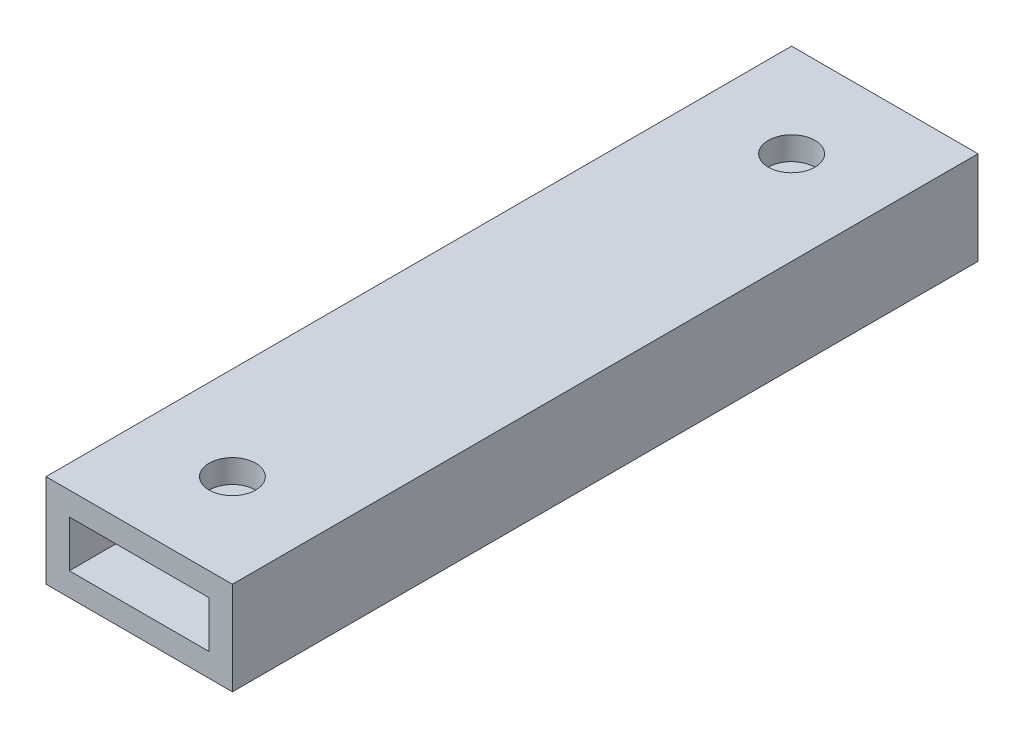
ISO-10303-21;
HEADER;
FILE_DESCRIPTION(('STEP AP214'),'2;1');
FILE_NAME('part.step','',(''),(''),'','','');
FILE_SCHEMA(('AUTOMOTIVE_DESIGN { 1 0 10303 214 1 1 1 1 }'));
ENDSEC;
DATA;
#1=APPLICATION_CONTEXT('core data for automotive mechanical design processes');
#2=APPLICATION_PROTOCOL_DEFINITION('international standard','automotive_design',2000,#1);
#3=PRODUCT_CONTEXT('',#1,'mechanical');
#4=PRODUCT('Part','Part','',(#3));
#5=PRODUCT_RELATED_PRODUCT_CATEGORY('part','',(#4));
#6=PRODUCT_DEFINITION_FORMATION('','',#4);
#7=PRODUCT_DEFINITION_CONTEXT('part definition',#1,'design');
#8=PRODUCT_DEFINITION('design','',#6,#7);
#9=PRODUCT_DEFINITION_SHAPE('','',#8);
#10=(LENGTH_UNIT() NAMED_UNIT(*) SI_UNIT(.MILLI.,.METRE.));
#11=(NAMED_UNIT(*) PLANE_ANGLE_UNIT() SI_UNIT($,.RADIAN.));
#12=(NAMED_UNIT(*) SI_UNIT($,.STERADIAN.) SOLID_ANGLE_UNIT());
#13=UNCERTAINTY_MEASURE_WITH_UNIT(LENGTH_MEASURE(1.E-05),#10,'distance_accuracy_value','');
#14=(GEOMETRIC_REPRESENTATION_CONTEXT(3) GLOBAL_UNCERTAINTY_ASSIGNED_CONTEXT((#13)) GLOBAL_UNIT_ASSIGNED_CONTEXT((#10,
#11,#12)) REPRESENTATION_CONTEXT('',''));
#15=CARTESIAN_POINT('',(0.,0.,0.));
#16=DIRECTION('',(0.,0.,1.));
#17=DIRECTION('',(1.,0.,0.));
#18=AXIS2_PLACEMENT_3D('',#15,#16,#17);
#19=CARTESIAN_POINT('',(0.,0.,101.6));
#20=DIRECTION('',(0.,0.,-1.));
#21=DIRECTION('',(-1.,0.,0.));
#22=AXIS2_PLACEMENT_3D('',#19,#20,#21);
#23=PLANE('',#22);
#24=DIRECTION('',(0.,-1.,0.));
#25=VECTOR('',#24,1.);
#26=CARTESIAN_POINT('',(0.,0.,101.6));
#27=LINE('',#26,#25);
#28=CARTESIAN_POINT('',(0.,12.7,101.6));
#29=VERTEX_POINT('',#28);
#30=CARTESIAN_POINT('',(0.,0.,101.6));
#31=VERTEX_POINT('',#30);
#32=EDGE_CURVE('E175',#29,#31,#27,.T.);
#33=ORIENTED_EDGE('',*,*,#32,.T.);
#34=DIRECTION('',(1.,0.,0.));
#35=VECTOR('',#34,1.);
#36=CARTESIAN_POINT('',(0.,0.,101.6));
#37=LINE('',#36,#35);
#38=CARTESIAN_POINT('',(25.4,0.,101.6));
#39=VERTEX_POINT('',#38);
#40=EDGE_CURVE('E179',#31,#39,#37,.T.);
#41=ORIENTED_EDGE('',*,*,#40,.T.);
#42=DIRECTION('',(0.,1.,0.));
#43=VECTOR('',#42,1.);
#44=CARTESIAN_POINT('',(25.4,0.,101.6));
#45=LINE('',#44,#43);
#46=CARTESIAN_POINT('',(25.4,12.7,101.6));
#47=VERTEX_POINT('',#46);
#48=EDGE_CURVE('E183',#39,#47,#45,.T.);
#49=ORIENTED_EDGE('',*,*,#48,.T.);
#50=DIRECTION('',(-1.,0.,0.));
#51=VECTOR('',#50,1.);
#52=CARTESIAN_POINT('',(0.,12.7,101.6));
#53=LINE('',#52,#51);
#54=EDGE_CURVE('E186',#47,#29,#53,.T.);
#55=ORIENTED_EDGE('',*,*,#54,.T.);
#56=EDGE_LOOP('',(#33,#41,#49,#55));
#57=FACE_BOUND('',#56,.T.);
#58=DIRECTION('',(0.,-1.,0.));
#59=VECTOR('',#58,1.);
#60=CARTESIAN_POINT('',(3.175,3.175,101.6));
#61=LINE('',#60,#59);
#62=CARTESIAN_POINT('',(3.175,9.525,101.6));
#63=VERTEX_POINT('',#62);
#64=CARTESIAN_POINT('',(3.175,3.175,101.6));
#65=VERTEX_POINT('',#64);
#66=EDGE_CURVE('E124',#63,#65,#61,.T.);
#67=ORIENTED_EDGE('',*,*,#66,.F.);
#68=DIRECTION('',(-1.,0.,0.));
#69=VECTOR('',#68,1.);
#70=CARTESIAN_POINT('',(3.175,9.525,101.6));
#71=LINE('',#70,#69);
#72=CARTESIAN_POINT('',(22.225,9.525,101.6));
#73=VERTEX_POINT('',#72);
#74=EDGE_CURVE('E151',#73,#63,#71,.T.);
#75=ORIENTED_EDGE('',*,*,#74,.F.);
#76=DIRECTION('',(0.,1.,0.));
#77=VECTOR('',#76,1.);
#78=CARTESIAN_POINT('',(22.225,3.175,101.6));
#79=LINE('',#78,#77);
#80=CARTESIAN_POINT('',(22.225,3.175,101.6));
#81=VERTEX_POINT('',#80);
#82=EDGE_CURVE('E146',#81,#73,#79,.T.);
#83=ORIENTED_EDGE('',*,*,#82,.F.);
#84=DIRECTION('',(1.,0.,0.));
#85=VECTOR('',#84,1.);
#86=CARTESIAN_POINT('',(3.175,3.175,101.6));
#87=LINE('',#86,#85);
#88=EDGE_CURVE('E133',#65,#81,#87,.T.);
#89=ORIENTED_EDGE('',*,*,#88,.F.);
#90=EDGE_LOOP('',(#67,#75,#83,#89));
#91=FACE_BOUND('',#90,.T.);
#92=ADVANCED_FACE('F40',(#57,#91),#23,.F.);
#93=CARTESIAN_POINT('',(0.,0.,0.));
#94=DIRECTION('',(0.,0.,-1.));
#95=DIRECTION('',(-1.,0.,0.));
#96=AXIS2_PLACEMENT_3D('',#93,#94,#95);
#97=PLANE('',#96);
#98=DIRECTION('',(0.,-1.,0.));
#99=VECTOR('',#98,1.);
#100=CARTESIAN_POINT('',(0.,0.,0.));
#101=LINE('',#100,#99);
#102=CARTESIAN_POINT('',(0.,12.7,0.));
#103=VERTEX_POINT('',#102);
#104=CARTESIAN_POINT('',(0.,0.,0.));
#105=VERTEX_POINT('',#104);
#106=EDGE_CURVE('E142',#103,#105,#101,.T.);
#107=ORIENTED_EDGE('',*,*,#106,.F.);
#108=DIRECTION('',(-1.,0.,0.));
#109=VECTOR('',#108,1.);
#110=CARTESIAN_POINT('',(0.,12.7,0.));
#111=LINE('',#110,#109);
#112=CARTESIAN_POINT('',(25.4,12.7,0.));
#113=VERTEX_POINT('',#112);
#114=EDGE_CURVE('E180',#113,#103,#111,.T.);
#115=ORIENTED_EDGE('',*,*,#114,.F.);
#116=DIRECTION('',(0.,1.,0.));
#117=VECTOR('',#116,1.);
#118=CARTESIAN_POINT('',(25.4,0.,0.));
#119=LINE('',#118,#117);
#120=CARTESIAN_POINT('',(25.4,0.,0.));
#121=VERTEX_POINT('',#120);
#122=EDGE_CURVE('E196',#121,#113,#119,.T.);
#123=ORIENTED_EDGE('',*,*,#122,.F.);
#124=DIRECTION('',(1.,0.,0.));
#125=VECTOR('',#124,1.);
#126=CARTESIAN_POINT('',(0.,0.,0.));
#127=LINE('',#126,#125);
#128=EDGE_CURVE('E193',#105,#121,#127,.T.);
#129=ORIENTED_EDGE('',*,*,#128,.F.);
#130=EDGE_LOOP('',(#107,#115,#123,#129));
#131=FACE_BOUND('',#130,.T.);
#132=DIRECTION('',(-1.,0.,0.));
#133=VECTOR('',#132,1.);
#134=CARTESIAN_POINT('',(3.175,9.525,0.));
#135=LINE('',#134,#133);
#136=CARTESIAN_POINT('',(22.225,9.525,0.));
#137=VERTEX_POINT('',#136);
#138=CARTESIAN_POINT('',(3.175,9.525,0.));
#139=VERTEX_POINT('',#138);
#140=EDGE_CURVE('E134',#137,#139,#135,.T.);
#141=ORIENTED_EDGE('',*,*,#140,.T.);
#142=DIRECTION('',(0.,-1.,0.));
#143=VECTOR('',#142,1.);
#144=CARTESIAN_POINT('',(3.175,3.175,0.));
#145=LINE('',#144,#143);
#146=CARTESIAN_POINT('',(3.175,3.175,0.));
#147=VERTEX_POINT('',#146);
#148=EDGE_CURVE('E72',#139,#147,#145,.T.);
#149=ORIENTED_EDGE('',*,*,#148,.T.);
#150=DIRECTION('',(1.,0.,0.));
#151=VECTOR('',#150,1.);
#152=CARTESIAN_POINT('',(3.175,3.175,0.));
#153=LINE('',#152,#151);
#154=CARTESIAN_POINT('',(22.225,3.175,0.));
#155=VERTEX_POINT('',#154);
#156=EDGE_CURVE('E140',#147,#155,#153,.T.);
#157=ORIENTED_EDGE('',*,*,#156,.T.);
#158=DIRECTION('',(0.,1.,0.));
#159=VECTOR('',#158,1.);
#160=CARTESIAN_POINT('',(22.225,3.175,0.));
#161=LINE('',#160,#159);
#162=EDGE_CURVE('E162',#155,#137,#161,.T.);
#163=ORIENTED_EDGE('',*,*,#162,.T.);
#164=EDGE_LOOP('',(#141,#149,#157,#163));
#165=FACE_BOUND('',#164,.T.);
#166=ADVANCED_FACE('F255',(#131,#165),#97,.T.);
#167=CARTESIAN_POINT('',(0.,0.,101.6));
#168=DIRECTION('',(1.,0.,0.));
#169=DIRECTION('',(0.,0.,-1.));
#170=AXIS2_PLACEMENT_3D('',#167,#168,#169);
#171=PLANE('',#170);
#172=ORIENTED_EDGE('',*,*,#106,.T.);
#173=DIRECTION('',(0.,0.,-1.));
#174=VECTOR('',#173,1.);
#175=CARTESIAN_POINT('',(0.,0.,101.6));
#176=LINE('',#175,#174);
#177=EDGE_CURVE('E11',#31,#105,#176,.T.);
#178=ORIENTED_EDGE('',*,*,#177,.F.);
#179=ORIENTED_EDGE('',*,*,#32,.F.);
#180=DIRECTION('',(0.,0.,-1.));
#181=VECTOR('',#180,1.);
#182=CARTESIAN_POINT('',(0.,12.7,101.6));
#183=LINE('',#182,#181);
#184=EDGE_CURVE('E189',#29,#103,#183,.T.);
#185=ORIENTED_EDGE('',*,*,#184,.T.);
#186=EDGE_LOOP('',(#172,#178,#179,#185));
#187=FACE_BOUND('',#186,.T.);
#188=ADVANCED_FACE('F42',(#187),#171,.F.);
#189=CARTESIAN_POINT('',(0.,0.,101.6));
#190=DIRECTION('',(0.,1.,0.));
#191=DIRECTION('',(0.,0.,1.));
#192=AXIS2_PLACEMENT_3D('',#189,#190,#191);
#193=PLANE('',#192);
#194=CARTESIAN_POINT('',(12.7,0.,88.9));
#195=DIRECTION('',(0.,1.,0.));
#196=DIRECTION('',(0.,0.,1.));
#197=AXIS2_PLACEMENT_3D('',#194,#195,#196);
#198=CIRCLE('',#197,3.175);
#199=CARTESIAN_POINT('',(12.7,0.,92.075));
#200=VERTEX_POINT('',#199);
#201=EDGE_CURVE('E214',#200,#200,#198,.T.);
#202=ORIENTED_EDGE('',*,*,#201,.T.);
#203=EDGE_LOOP('',(#202));
#204=FACE_BOUND('',#203,.T.);
#205=CARTESIAN_POINT('',(12.7,0.,12.7));
#206=DIRECTION('',(0.,1.,0.));
#207=DIRECTION('',(0.,0.,1.));
#208=AXIS2_PLACEMENT_3D('',#205,#206,#207);
#209=CIRCLE('',#208,3.175);
#210=CARTESIAN_POINT('',(12.7,0.,15.875));
#211=VERTEX_POINT('',#210);
#212=EDGE_CURVE('E229',#211,#211,#209,.T.);
#213=ORIENTED_EDGE('',*,*,#212,.T.);
#214=EDGE_LOOP('',(#213));
#215=FACE_BOUND('',#214,.T.);
#216=ORIENTED_EDGE('',*,*,#128,.T.);
#217=DIRECTION('',(0.,0.,-1.));
#218=VECTOR('',#217,1.);
#219=CARTESIAN_POINT('',(25.4,0.,101.6));
#220=LINE('',#219,#218);
#221=EDGE_CURVE('E50',#39,#121,#220,.T.);
#222=ORIENTED_EDGE('',*,*,#221,.F.);
#223=ORIENTED_EDGE('',*,*,#40,.F.);
#224=ORIENTED_EDGE('',*,*,#177,.T.);
#225=EDGE_LOOP('',(#216,#222,#223,#224));
#226=FACE_BOUND('',#225,.T.);
#227=ADVANCED_FACE('F280',(#204,#215,#226),#193,.F.);
#228=CARTESIAN_POINT('',(25.4,0.,101.6));
#229=DIRECTION('',(-1.,0.,0.));
#230=DIRECTION('',(0.,0.,1.));
#231=AXIS2_PLACEMENT_3D('',#228,#229,#230);
#232=PLANE('',#231);
#233=ORIENTED_EDGE('',*,*,#122,.T.);
#234=DIRECTION('',(0.,0.,-1.));
#235=VECTOR('',#234,1.);
#236=CARTESIAN_POINT('',(25.4,12.7,101.6));
#237=LINE('',#236,#235);
#238=EDGE_CURVE('E204',#47,#113,#237,.T.);
#239=ORIENTED_EDGE('',*,*,#238,.F.);
#240=ORIENTED_EDGE('',*,*,#48,.F.);
#241=ORIENTED_EDGE('',*,*,#221,.T.);
#242=EDGE_LOOP('',(#233,#239,#240,#241));
#243=FACE_BOUND('',#242,.T.);
#244=ADVANCED_FACE('F277',(#243),#232,.F.);
#245=CARTESIAN_POINT('',(0.,12.7,101.6));
#246=DIRECTION('',(0.,-1.,0.));
#247=DIRECTION('',(0.,0.,-1.));
#248=AXIS2_PLACEMENT_3D('',#245,#246,#247);
#249=PLANE('',#248);
#250=CARTESIAN_POINT('',(12.7,12.7,88.9));
#251=DIRECTION('',(0.,1.,0.));
#252=DIRECTION('',(0.,0.,1.));
#253=AXIS2_PLACEMENT_3D('',#250,#251,#252);
#254=CIRCLE('',#253,3.175);
#255=CARTESIAN_POINT('',(12.7,12.7,92.075));
#256=VERTEX_POINT('',#255);
#257=EDGE_CURVE('E222',#256,#256,#254,.T.);
#258=ORIENTED_EDGE('',*,*,#257,.F.);
#259=EDGE_LOOP('',(#258));
#260=FACE_BOUND('',#259,.T.);
#261=CARTESIAN_POINT('',(12.7,12.7,12.7));
#262=DIRECTION('',(0.,1.,0.));
#263=DIRECTION('',(0.,0.,1.));
#264=AXIS2_PLACEMENT_3D('',#261,#262,#263);
#265=CIRCLE('',#264,3.175);
#266=CARTESIAN_POINT('',(12.7,12.7,15.875));
#267=VERTEX_POINT('',#266);
#268=EDGE_CURVE('E235',#267,#267,#265,.T.);
#269=ORIENTED_EDGE('',*,*,#268,.F.);
#270=EDGE_LOOP('',(#269));
#271=FACE_BOUND('',#270,.T.);
#272=ORIENTED_EDGE('',*,*,#114,.T.);
#273=ORIENTED_EDGE('',*,*,#184,.F.);
#274=ORIENTED_EDGE('',*,*,#54,.F.);
#275=ORIENTED_EDGE('',*,*,#238,.T.);
#276=EDGE_LOOP('',(#272,#273,#274,#275));
#277=FACE_BOUND('',#276,.T.);
#278=ADVANCED_FACE('F274',(#260,#271,#277),#249,.F.);
#279=CARTESIAN_POINT('',(3.175,3.175,101.6));
#280=DIRECTION('',(1.,0.,0.));
#281=DIRECTION('',(0.,0.,-1.));
#282=AXIS2_PLACEMENT_3D('',#279,#280,#281);
#283=PLANE('',#282);
#284=ORIENTED_EDGE('',*,*,#148,.F.);
#285=DIRECTION('',(0.,0.,-1.));
#286=VECTOR('',#285,1.);
#287=CARTESIAN_POINT('',(3.175,9.525,101.6));
#288=LINE('',#287,#286);
#289=EDGE_CURVE('E128',#63,#139,#288,.T.);
#290=ORIENTED_EDGE('',*,*,#289,.F.);
#291=ORIENTED_EDGE('',*,*,#66,.T.);
#292=DIRECTION('',(0.,0.,-1.));
#293=VECTOR('',#292,1.);
#294=CARTESIAN_POINT('',(3.175,3.175,101.6));
#295=LINE('',#294,#293);
#296=EDGE_CURVE('E127',#65,#147,#295,.T.);
#297=ORIENTED_EDGE('',*,*,#296,.T.);
#298=EDGE_LOOP('',(#284,#290,#291,#297));
#299=FACE_BOUND('',#298,.T.);
#300=ADVANCED_FACE('F126',(#299),#283,.T.);
#301=CARTESIAN_POINT('',(3.175,3.175,101.6));
#302=DIRECTION('',(0.,1.,0.));
#303=DIRECTION('',(0.,0.,1.));
#304=AXIS2_PLACEMENT_3D('',#301,#302,#303);
#305=PLANE('',#304);
#306=CARTESIAN_POINT('',(12.7,3.175,88.9));
#307=DIRECTION('',(0.,1.,0.));
#308=DIRECTION('',(0.,0.,1.));
#309=AXIS2_PLACEMENT_3D('',#306,#307,#308);
#310=CIRCLE('',#309,3.175);
#311=CARTESIAN_POINT('',(12.7,3.175,92.075));
#312=VERTEX_POINT('',#311);
#313=EDGE_CURVE('E159',#312,#312,#310,.T.);
#314=ORIENTED_EDGE('',*,*,#313,.F.);
#315=EDGE_LOOP('',(#314));
#316=FACE_BOUND('',#315,.T.);
#317=CARTESIAN_POINT('',(12.7,3.175,12.7));
#318=DIRECTION('',(0.,1.,0.));
#319=DIRECTION('',(0.,0.,1.));
#320=AXIS2_PLACEMENT_3D('',#317,#318,#319);
#321=CIRCLE('',#320,3.175);
#322=CARTESIAN_POINT('',(12.7,3.175,15.875));
#323=VERTEX_POINT('',#322);
#324=EDGE_CURVE('E213',#323,#323,#321,.T.);
#325=ORIENTED_EDGE('',*,*,#324,.F.);
#326=EDGE_LOOP('',(#325));
#327=FACE_BOUND('',#326,.T.);
#328=ORIENTED_EDGE('',*,*,#156,.F.);
#329=ORIENTED_EDGE('',*,*,#296,.F.);
#330=ORIENTED_EDGE('',*,*,#88,.T.);
#331=DIRECTION('',(0.,0.,-1.));
#332=VECTOR('',#331,1.);
#333=CARTESIAN_POINT('',(22.225,3.175,101.6));
#334=LINE('',#333,#332);
#335=EDGE_CURVE('E143',#81,#155,#334,.T.);
#336=ORIENTED_EDGE('',*,*,#335,.T.);
#337=EDGE_LOOP('',(#328,#329,#330,#336));
#338=FACE_BOUND('',#337,.T.);
#339=ADVANCED_FACE('F137',(#316,#327,#338),#305,.T.);
#340=CARTESIAN_POINT('',(22.225,3.175,101.6));
#341=DIRECTION('',(-1.,0.,0.));
#342=DIRECTION('',(0.,0.,1.));
#343=AXIS2_PLACEMENT_3D('',#340,#341,#342);
#344=PLANE('',#343);
#345=ORIENTED_EDGE('',*,*,#162,.F.);
#346=ORIENTED_EDGE('',*,*,#335,.F.);
#347=ORIENTED_EDGE('',*,*,#82,.T.);
#348=DIRECTION('',(0.,0.,-1.));
#349=VECTOR('',#348,1.);
#350=CARTESIAN_POINT('',(22.225,9.525,101.6));
#351=LINE('',#350,#349);
#352=EDGE_CURVE('E61',#73,#137,#351,.T.);
#353=ORIENTED_EDGE('',*,*,#352,.T.);
#354=EDGE_LOOP('',(#345,#346,#347,#353));
#355=FACE_BOUND('',#354,.T.);
#356=ADVANCED_FACE('F251',(#355),#344,.T.);
#357=CARTESIAN_POINT('',(3.175,9.525,101.6));
#358=DIRECTION('',(0.,-1.,0.));
#359=DIRECTION('',(0.,0.,-1.));
#360=AXIS2_PLACEMENT_3D('',#357,#358,#359);
#361=PLANE('',#360);
#362=CARTESIAN_POINT('',(12.7,9.525,88.9));
#363=DIRECTION('',(0.,-1.,0.));
#364=DIRECTION('',(0.,0.,-1.));
#365=AXIS2_PLACEMENT_3D('',#362,#363,#364);
#366=CIRCLE('',#365,3.175);
#367=CARTESIAN_POINT('',(12.7,9.525,85.725));
#368=VERTEX_POINT('',#367);
#369=EDGE_CURVE('E44',#368,#368,#366,.T.);
#370=ORIENTED_EDGE('',*,*,#369,.F.);
#371=EDGE_LOOP('',(#370));
#372=FACE_BOUND('',#371,.T.);
#373=CARTESIAN_POINT('',(12.7,9.525,12.7));
#374=DIRECTION('',(0.,-1.,0.));
#375=DIRECTION('',(0.,0.,-1.));
#376=AXIS2_PLACEMENT_3D('',#373,#374,#375);
#377=CIRCLE('',#376,3.175);
#378=CARTESIAN_POINT('',(12.7,9.525,9.525));
#379=VERTEX_POINT('',#378);
#380=EDGE_CURVE('E210',#379,#379,#377,.T.);
#381=ORIENTED_EDGE('',*,*,#380,.F.);
#382=EDGE_LOOP('',(#381));
#383=FACE_BOUND('',#382,.T.);
#384=ORIENTED_EDGE('',*,*,#140,.F.);
#385=ORIENTED_EDGE('',*,*,#352,.F.);
#386=ORIENTED_EDGE('',*,*,#74,.T.);
#387=ORIENTED_EDGE('',*,*,#289,.T.);
#388=EDGE_LOOP('',(#384,#385,#386,#387));
#389=FACE_BOUND('',#388,.T.);
#390=ADVANCED_FACE('F247',(#372,#383,#389),#361,.T.);
#391=CARTESIAN_POINT('',(12.7,0.,12.7));
#392=DIRECTION('',(0.,1.,0.));
#393=DIRECTION('',(0.,0.,1.));
#394=AXIS2_PLACEMENT_3D('',#391,#392,#393);
#395=CYLINDRICAL_SURFACE('',#394,3.175);
#396=ORIENTED_EDGE('',*,*,#380,.T.);
#397=EDGE_LOOP('',(#396));
#398=FACE_BOUND('',#397,.T.);
#399=ORIENTED_EDGE('',*,*,#268,.T.);
#400=EDGE_LOOP('',(#399));
#401=FACE_BOUND('',#400,.T.);
#402=ADVANCED_FACE('F250',(#398,#401),#395,.F.);
#403=CARTESIAN_POINT('',(12.7,0.,88.9));
#404=DIRECTION('',(0.,1.,0.));
#405=DIRECTION('',(0.,0.,1.));
#406=AXIS2_PLACEMENT_3D('',#403,#404,#405);
#407=CYLINDRICAL_SURFACE('',#406,3.175);
#408=ORIENTED_EDGE('',*,*,#369,.T.);
#409=EDGE_LOOP('',(#408));
#410=FACE_BOUND('',#409,.T.);
#411=ORIENTED_EDGE('',*,*,#257,.T.);
#412=EDGE_LOOP('',(#411));
#413=FACE_BOUND('',#412,.T.);
#414=ADVANCED_FACE('F244',(#410,#413),#407,.F.);
#415=ORIENTED_EDGE('',*,*,#324,.T.);
#416=EDGE_LOOP('',(#415));
#417=FACE_BOUND('',#416,.T.);
#418=ORIENTED_EDGE('',*,*,#212,.F.);
#419=EDGE_LOOP('',(#418));
#420=FACE_BOUND('',#419,.T.);
#421=ADVANCED_FACE('F302',(#417,#420),#395,.F.);
#422=ORIENTED_EDGE('',*,*,#313,.T.);
#423=EDGE_LOOP('',(#422));
#424=FACE_BOUND('',#423,.T.);
#425=ORIENTED_EDGE('',*,*,#201,.F.);
#426=EDGE_LOOP('',(#425));
#427=FACE_BOUND('',#426,.T.);
#428=ADVANCED_FACE('F304',(#424,#427),#407,.F.);
#429=CLOSED_SHELL('',(#92,#166,#188,#227,#244,#278,#300,#339,#356,#390,#402,#414,#421,#428));
#430=MANIFOLD_SOLID_BREP('B2',#429);
#431=ADVANCED_BREP_SHAPE_REPRESENTATION('',(#18,#430),#14);
#432=SHAPE_DEFINITION_REPRESENTATION(#9,#431);
ENDSEC;
END-ISO-10303-21;
